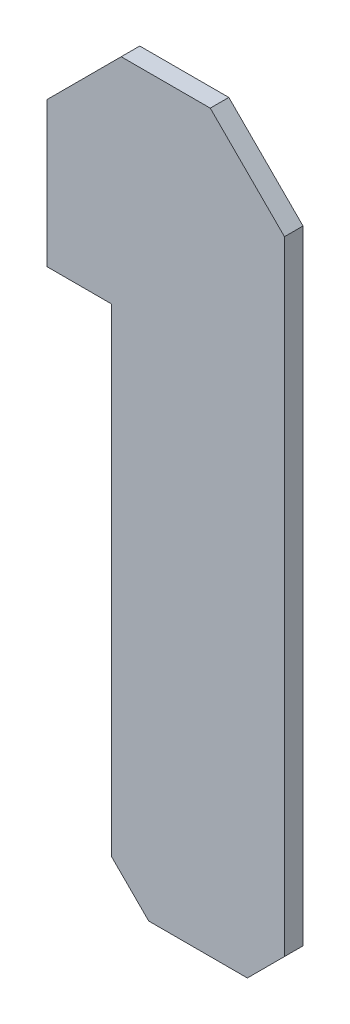
ISO-10303-21;
HEADER;
FILE_DESCRIPTION(('STEP AP214'),'2;1');
FILE_NAME('part.step','',(''),(''),'','','');
FILE_SCHEMA(('AUTOMOTIVE_DESIGN { 1 0 10303 214 1 1 1 1 }'));
ENDSEC;
DATA;
#1=APPLICATION_CONTEXT('core data for automotive mechanical design processes');
#2=APPLICATION_PROTOCOL_DEFINITION('international standard','automotive_design',2000,#1);
#3=PRODUCT_CONTEXT('',#1,'mechanical');
#4=PRODUCT('Part','Part','',(#3));
#5=PRODUCT_RELATED_PRODUCT_CATEGORY('part','',(#4));
#6=PRODUCT_DEFINITION_FORMATION('','',#4);
#7=PRODUCT_DEFINITION_CONTEXT('part definition',#1,'design');
#8=PRODUCT_DEFINITION('design','',#6,#7);
#9=PRODUCT_DEFINITION_SHAPE('','',#8);
#10=(LENGTH_UNIT() NAMED_UNIT(*) SI_UNIT(.MILLI.,.METRE.));
#11=(NAMED_UNIT(*) PLANE_ANGLE_UNIT() SI_UNIT($,.RADIAN.));
#12=(NAMED_UNIT(*) SI_UNIT($,.STERADIAN.) SOLID_ANGLE_UNIT());
#13=UNCERTAINTY_MEASURE_WITH_UNIT(LENGTH_MEASURE(1.E-05),#10,'distance_accuracy_value','');
#14=(GEOMETRIC_REPRESENTATION_CONTEXT(3) GLOBAL_UNCERTAINTY_ASSIGNED_CONTEXT((#13)) GLOBAL_UNIT_ASSIGNED_CONTEXT((#10,
#11,#12)) REPRESENTATION_CONTEXT('',''));
#15=CARTESIAN_POINT('',(0.,0.,0.));
#16=DIRECTION('',(0.,0.,1.));
#17=DIRECTION('',(1.,0.,0.));
#18=AXIS2_PLACEMENT_3D('',#15,#16,#17);
#19=CARTESIAN_POINT('',(6.4,3.15,0.5));
#20=DIRECTION('',(-0.707106781186546,-0.707106781186549,0.));
#21=DIRECTION('',(0.707106781186549,-0.707106781186546,0.));
#22=AXIS2_PLACEMENT_3D('',#19,#20,#21);
#23=PLANE('',#22);
#24=DIRECTION('',(-0.707106781186549,0.707106781186546,0.));
#25=VECTOR('',#24,1.);
#26=CARTESIAN_POINT('',(6.4,3.15,0.));
#27=LINE('',#26,#25);
#28=CARTESIAN_POINT('',(6.4,3.15,0.));
#29=VERTEX_POINT('',#28);
#30=CARTESIAN_POINT('',(4.39999999999999,5.15,0.));
#31=VERTEX_POINT('',#30);
#32=EDGE_CURVE('E143',#29,#31,#27,.T.);
#33=ORIENTED_EDGE('',*,*,#32,.T.);
#34=DIRECTION('',(0.,0.,-1.));
#35=VECTOR('',#34,1.);
#36=CARTESIAN_POINT('',(4.39999999999999,5.15,0.5));
#37=LINE('',#36,#35);
#38=CARTESIAN_POINT('',(4.39999999999999,5.15,0.5));
#39=VERTEX_POINT('',#38);
#40=EDGE_CURVE('E11',#39,#31,#37,.T.);
#41=ORIENTED_EDGE('',*,*,#40,.F.);
#42=DIRECTION('',(-0.707106781186549,0.707106781186546,0.));
#43=VECTOR('',#42,1.);
#44=CARTESIAN_POINT('',(6.4,3.15,0.5));
#45=LINE('',#44,#43);
#46=CARTESIAN_POINT('',(6.4,3.15,0.5));
#47=VERTEX_POINT('',#46);
#48=EDGE_CURVE('E163',#47,#39,#45,.T.);
#49=ORIENTED_EDGE('',*,*,#48,.F.);
#50=DIRECTION('',(0.,0.,-1.));
#51=VECTOR('',#50,1.);
#52=CARTESIAN_POINT('',(6.4,3.15,0.5));
#53=LINE('',#52,#51);
#54=EDGE_CURVE('E139',#47,#29,#53,.T.);
#55=ORIENTED_EDGE('',*,*,#54,.T.);
#56=EDGE_LOOP('',(#33,#41,#49,#55));
#57=FACE_BOUND('',#56,.T.);
#58=ADVANCED_FACE('F34',(#57),#23,.F.);
#59=CARTESIAN_POINT('',(4.39999999999999,5.15,0.5));
#60=DIRECTION('',(0.,-1.,0.));
#61=DIRECTION('',(0.,0.,-1.));
#62=AXIS2_PLACEMENT_3D('',#59,#60,#61);
#63=PLANE('',#62);
#64=DIRECTION('',(-1.,0.,0.));
#65=VECTOR('',#64,1.);
#66=CARTESIAN_POINT('',(4.39999999999999,5.15,0.));
#67=LINE('',#66,#65);
#68=CARTESIAN_POINT('',(2.,5.15,0.));
#69=VERTEX_POINT('',#68);
#70=EDGE_CURVE('E146',#31,#69,#67,.T.);
#71=ORIENTED_EDGE('',*,*,#70,.T.);
#72=DIRECTION('',(0.,0.,-1.));
#73=VECTOR('',#72,1.);
#74=CARTESIAN_POINT('',(2.,5.15,0.5));
#75=LINE('',#74,#73);
#76=CARTESIAN_POINT('',(2.,5.15,0.5));
#77=VERTEX_POINT('',#76);
#78=EDGE_CURVE('E42',#77,#69,#75,.T.);
#79=ORIENTED_EDGE('',*,*,#78,.F.);
#80=DIRECTION('',(-1.,0.,0.));
#81=VECTOR('',#80,1.);
#82=CARTESIAN_POINT('',(4.39999999999999,5.15,0.5));
#83=LINE('',#82,#81);
#84=EDGE_CURVE('E97',#39,#77,#83,.T.);
#85=ORIENTED_EDGE('',*,*,#84,.F.);
#86=ORIENTED_EDGE('',*,*,#40,.T.);
#87=EDGE_LOOP('',(#71,#79,#85,#86));
#88=FACE_BOUND('',#87,.T.);
#89=ADVANCED_FACE('F209',(#88),#63,.F.);
#90=CARTESIAN_POINT('',(2.,5.15,0.5));
#91=DIRECTION('',(0.707106781186549,-0.707106781186547,0.));
#92=DIRECTION('',(0.707106781186547,0.707106781186549,0.));
#93=AXIS2_PLACEMENT_3D('',#90,#91,#92);
#94=PLANE('',#93);
#95=DIRECTION('',(-0.707106781186547,-0.707106781186549,0.));
#96=VECTOR('',#95,1.);
#97=CARTESIAN_POINT('',(2.,5.15,0.));
#98=LINE('',#97,#96);
#99=CARTESIAN_POINT('',(0.,3.15,0.));
#100=VERTEX_POINT('',#99);
#101=EDGE_CURVE('E148',#69,#100,#98,.T.);
#102=ORIENTED_EDGE('',*,*,#101,.T.);
#103=DIRECTION('',(0.,0.,-1.));
#104=VECTOR('',#103,1.);
#105=CARTESIAN_POINT('',(0.,3.15,0.5));
#106=LINE('',#105,#104);
#107=CARTESIAN_POINT('',(0.,3.15,0.5));
#108=VERTEX_POINT('',#107);
#109=EDGE_CURVE('E176',#108,#100,#106,.T.);
#110=ORIENTED_EDGE('',*,*,#109,.F.);
#111=DIRECTION('',(-0.707106781186547,-0.707106781186549,0.));
#112=VECTOR('',#111,1.);
#113=CARTESIAN_POINT('',(2.,5.15,0.5));
#114=LINE('',#113,#112);
#115=EDGE_CURVE('E184',#77,#108,#114,.T.);
#116=ORIENTED_EDGE('',*,*,#115,.F.);
#117=ORIENTED_EDGE('',*,*,#78,.T.);
#118=EDGE_LOOP('',(#102,#110,#116,#117));
#119=FACE_BOUND('',#118,.T.);
#120=ADVANCED_FACE('F182',(#119),#94,.F.);
#121=CARTESIAN_POINT('',(0.,0.100000000000001,0.5));
#122=DIRECTION('',(1.,0.,0.));
#123=DIRECTION('',(0.,1.,0.));
#124=AXIS2_PLACEMENT_3D('',#121,#122,#123);
#125=PLANE('',#124);
#126=DIRECTION('',(0.,-1.,0.));
#127=VECTOR('',#126,1.);
#128=CARTESIAN_POINT('',(0.,0.100000000000001,0.));
#129=LINE('',#128,#127);
#130=CARTESIAN_POINT('',(0.,-0.75,0.));
#131=VERTEX_POINT('',#130);
#132=EDGE_CURVE('E151',#100,#131,#129,.T.);
#133=ORIENTED_EDGE('',*,*,#132,.T.);
#134=DIRECTION('',(0.,0.,-1.));
#135=VECTOR('',#134,1.);
#136=CARTESIAN_POINT('',(0.,-0.75,0.5));
#137=LINE('',#136,#135);
#138=CARTESIAN_POINT('',(0.,-0.75,0.5));
#139=VERTEX_POINT('',#138);
#140=EDGE_CURVE('E173',#139,#131,#137,.T.);
#141=ORIENTED_EDGE('',*,*,#140,.F.);
#142=DIRECTION('',(0.,-1.,0.));
#143=VECTOR('',#142,1.);
#144=CARTESIAN_POINT('',(0.,3.15,0.5));
#145=LINE('',#144,#143);
#146=EDGE_CURVE('E199',#108,#139,#145,.T.);
#147=ORIENTED_EDGE('',*,*,#146,.F.);
#148=ORIENTED_EDGE('',*,*,#109,.T.);
#149=EDGE_LOOP('',(#133,#141,#147,#148));
#150=FACE_BOUND('',#149,.T.);
#151=ADVANCED_FACE('F190',(#150),#125,.F.);
#152=CARTESIAN_POINT('',(0.,-0.75,0.5));
#153=DIRECTION('',(0.,1.,0.));
#154=DIRECTION('',(0.,0.,1.));
#155=AXIS2_PLACEMENT_3D('',#152,#153,#154);
#156=PLANE('',#155);
#157=DIRECTION('',(1.,0.,0.));
#158=VECTOR('',#157,1.);
#159=CARTESIAN_POINT('',(0.,-0.75,0.));
#160=LINE('',#159,#158);
#161=CARTESIAN_POINT('',(1.7422791503867,-0.75,0.));
#162=VERTEX_POINT('',#161);
#163=EDGE_CURVE('E153',#131,#162,#160,.T.);
#164=ORIENTED_EDGE('',*,*,#163,.T.);
#165=DIRECTION('',(0.,0.,-1.));
#166=VECTOR('',#165,1.);
#167=CARTESIAN_POINT('',(1.7422791503867,-0.75,0.5));
#168=LINE('',#167,#166);
#169=CARTESIAN_POINT('',(1.7422791503867,-0.75,0.5));
#170=VERTEX_POINT('',#169);
#171=EDGE_CURVE('E170',#170,#162,#168,.T.);
#172=ORIENTED_EDGE('',*,*,#171,.F.);
#173=DIRECTION('',(1.,0.,0.));
#174=VECTOR('',#173,1.);
#175=CARTESIAN_POINT('',(0.,-0.75,0.5));
#176=LINE('',#175,#174);
#177=EDGE_CURVE('E196',#139,#170,#176,.T.);
#178=ORIENTED_EDGE('',*,*,#177,.F.);
#179=ORIENTED_EDGE('',*,*,#140,.T.);
#180=EDGE_LOOP('',(#164,#172,#178,#179));
#181=FACE_BOUND('',#180,.T.);
#182=ADVANCED_FACE('F194',(#181),#156,.F.);
#183=CARTESIAN_POINT('',(1.7422791503867,-0.75,0.5));
#184=DIRECTION('',(1.,0.,0.));
#185=DIRECTION('',(0.,1.,0.));
#186=AXIS2_PLACEMENT_3D('',#183,#184,#185);
#187=PLANE('',#186);
#188=DIRECTION('',(0.,-1.,0.));
#189=VECTOR('',#188,1.);
#190=CARTESIAN_POINT('',(1.7422791503867,-0.75,0.));
#191=LINE('',#190,#189);
#192=CARTESIAN_POINT('',(1.7422791503867,-13.65,0.));
#193=VERTEX_POINT('',#192);
#194=EDGE_CURVE('E155',#162,#193,#191,.T.);
#195=ORIENTED_EDGE('',*,*,#194,.T.);
#196=DIRECTION('',(0.,0.,-1.));
#197=VECTOR('',#196,1.);
#198=CARTESIAN_POINT('',(1.7422791503867,-13.65,0.5));
#199=LINE('',#198,#197);
#200=CARTESIAN_POINT('',(1.7422791503867,-13.65,0.5));
#201=VERTEX_POINT('',#200);
#202=EDGE_CURVE('E167',#201,#193,#199,.T.);
#203=ORIENTED_EDGE('',*,*,#202,.F.);
#204=DIRECTION('',(0.,-1.,0.));
#205=VECTOR('',#204,1.);
#206=CARTESIAN_POINT('',(1.7422791503867,-0.75,0.5));
#207=LINE('',#206,#205);
#208=EDGE_CURVE('E198',#170,#201,#207,.T.);
#209=ORIENTED_EDGE('',*,*,#208,.F.);
#210=ORIENTED_EDGE('',*,*,#171,.T.);
#211=EDGE_LOOP('',(#195,#203,#209,#210));
#212=FACE_BOUND('',#211,.T.);
#213=ADVANCED_FACE('F221',(#212),#187,.F.);
#214=CARTESIAN_POINT('',(1.7422791503867,-13.65,0.5));
#215=DIRECTION('',(0.707106781186548,0.707106781186547,0.));
#216=DIRECTION('',(-0.707106781186547,0.707106781186548,0.));
#217=AXIS2_PLACEMENT_3D('',#214,#215,#216);
#218=PLANE('',#217);
#219=DIRECTION('',(0.707106781186547,-0.707106781186548,0.));
#220=VECTOR('',#219,1.);
#221=CARTESIAN_POINT('',(1.7422791503867,-13.65,0.));
#222=LINE('',#221,#220);
#223=CARTESIAN_POINT('',(2.7422791503867,-14.65,0.));
#224=VERTEX_POINT('',#223);
#225=EDGE_CURVE('E157',#193,#224,#222,.T.);
#226=ORIENTED_EDGE('',*,*,#225,.T.);
#227=DIRECTION('',(0.,0.,-1.));
#228=VECTOR('',#227,1.);
#229=CARTESIAN_POINT('',(2.7422791503867,-14.65,0.5));
#230=LINE('',#229,#228);
#231=CARTESIAN_POINT('',(2.7422791503867,-14.65,0.5));
#232=VERTEX_POINT('',#231);
#233=EDGE_CURVE('E134',#232,#224,#230,.T.);
#234=ORIENTED_EDGE('',*,*,#233,.F.);
#235=DIRECTION('',(0.707106781186547,-0.707106781186548,0.));
#236=VECTOR('',#235,1.);
#237=CARTESIAN_POINT('',(1.7422791503867,-13.65,0.5));
#238=LINE('',#237,#236);
#239=EDGE_CURVE('E123',#201,#232,#238,.T.);
#240=ORIENTED_EDGE('',*,*,#239,.F.);
#241=ORIENTED_EDGE('',*,*,#202,.T.);
#242=EDGE_LOOP('',(#226,#234,#240,#241));
#243=FACE_BOUND('',#242,.T.);
#244=ADVANCED_FACE('F224',(#243),#218,.F.);
#245=CARTESIAN_POINT('',(2.7422791503867,-14.65,0.5));
#246=DIRECTION('',(0.,1.,0.));
#247=DIRECTION('',(0.,0.,1.));
#248=AXIS2_PLACEMENT_3D('',#245,#246,#247);
#249=PLANE('',#248);
#250=DIRECTION('',(1.,0.,0.));
#251=VECTOR('',#250,1.);
#252=CARTESIAN_POINT('',(2.7422791503867,-14.65,0.));
#253=LINE('',#252,#251);
#254=CARTESIAN_POINT('',(5.4,-14.65,0.));
#255=VERTEX_POINT('',#254);
#256=EDGE_CURVE('E132',#224,#255,#253,.T.);
#257=ORIENTED_EDGE('',*,*,#256,.T.);
#258=DIRECTION('',(0.,0.,-1.));
#259=VECTOR('',#258,1.);
#260=CARTESIAN_POINT('',(5.4,-14.65,0.5));
#261=LINE('',#260,#259);
#262=CARTESIAN_POINT('',(5.4,-14.65,0.5));
#263=VERTEX_POINT('',#262);
#264=EDGE_CURVE('E129',#263,#255,#261,.T.);
#265=ORIENTED_EDGE('',*,*,#264,.F.);
#266=DIRECTION('',(1.,0.,0.));
#267=VECTOR('',#266,1.);
#268=CARTESIAN_POINT('',(2.7422791503867,-14.65,0.5));
#269=LINE('',#268,#267);
#270=EDGE_CURVE('E116',#232,#263,#269,.T.);
#271=ORIENTED_EDGE('',*,*,#270,.F.);
#272=ORIENTED_EDGE('',*,*,#233,.T.);
#273=EDGE_LOOP('',(#257,#265,#271,#272));
#274=FACE_BOUND('',#273,.T.);
#275=ADVANCED_FACE('F130',(#274),#249,.F.);
#276=CARTESIAN_POINT('',(5.4,-14.65,0.5));
#277=DIRECTION('',(-0.707106781186547,0.707106781186547,0.));
#278=DIRECTION('',(-0.707106781186548,-0.707106781186548,0.));
#279=AXIS2_PLACEMENT_3D('',#276,#277,#278);
#280=PLANE('',#279);
#281=DIRECTION('',(0.707106781186547,0.707106781186547,0.));
#282=VECTOR('',#281,1.);
#283=CARTESIAN_POINT('',(5.4,-14.65,0.));
#284=LINE('',#283,#282);
#285=CARTESIAN_POINT('',(6.4,-13.65,0.));
#286=VERTEX_POINT('',#285);
#287=EDGE_CURVE('E160',#255,#286,#284,.T.);
#288=ORIENTED_EDGE('',*,*,#287,.T.);
#289=DIRECTION('',(0.,0.,-1.));
#290=VECTOR('',#289,1.);
#291=CARTESIAN_POINT('',(6.4,-13.65,0.5));
#292=LINE('',#291,#290);
#293=CARTESIAN_POINT('',(6.4,-13.65,0.5));
#294=VERTEX_POINT('',#293);
#295=EDGE_CURVE('E135',#294,#286,#292,.T.);
#296=ORIENTED_EDGE('',*,*,#295,.F.);
#297=DIRECTION('',(0.707106781186547,0.707106781186547,0.));
#298=VECTOR('',#297,1.);
#299=CARTESIAN_POINT('',(5.4,-14.65,0.5));
#300=LINE('',#299,#298);
#301=EDGE_CURVE('E120',#263,#294,#300,.T.);
#302=ORIENTED_EDGE('',*,*,#301,.F.);
#303=ORIENTED_EDGE('',*,*,#264,.T.);
#304=EDGE_LOOP('',(#288,#296,#302,#303));
#305=FACE_BOUND('',#304,.T.);
#306=ADVANCED_FACE('F137',(#305),#280,.F.);
#307=CARTESIAN_POINT('',(6.4,3.15,0.5));
#308=DIRECTION('',(-1.,0.,0.));
#309=DIRECTION('',(0.,0.,1.));
#310=AXIS2_PLACEMENT_3D('',#307,#308,#309);
#311=PLANE('',#310);
#312=DIRECTION('',(0.,1.,0.));
#313=VECTOR('',#312,1.);
#314=CARTESIAN_POINT('',(6.4,3.15,0.));
#315=LINE('',#314,#313);
#316=EDGE_CURVE('E85',#286,#29,#315,.T.);
#317=ORIENTED_EDGE('',*,*,#316,.T.);
#318=ORIENTED_EDGE('',*,*,#54,.F.);
#319=DIRECTION('',(0.,1.,0.));
#320=VECTOR('',#319,1.);
#321=CARTESIAN_POINT('',(6.4,-13.65,0.5));
#322=LINE('',#321,#320);
#323=EDGE_CURVE('E50',#294,#47,#322,.T.);
#324=ORIENTED_EDGE('',*,*,#323,.F.);
#325=ORIENTED_EDGE('',*,*,#295,.T.);
#326=EDGE_LOOP('',(#317,#318,#324,#325));
#327=FACE_BOUND('',#326,.T.);
#328=ADVANCED_FACE('F233',(#327),#311,.F.);
#329=CARTESIAN_POINT('',(0.,0.,0.5));
#330=DIRECTION('',(0.,0.,1.));
#331=DIRECTION('',(1.,0.,0.));
#332=AXIS2_PLACEMENT_3D('',#329,#330,#331);
#333=PLANE('',#332);
#334=ORIENTED_EDGE('',*,*,#48,.T.);
#335=ORIENTED_EDGE('',*,*,#84,.T.);
#336=ORIENTED_EDGE('',*,*,#115,.T.);
#337=ORIENTED_EDGE('',*,*,#146,.T.);
#338=ORIENTED_EDGE('',*,*,#177,.T.);
#339=ORIENTED_EDGE('',*,*,#208,.T.);
#340=ORIENTED_EDGE('',*,*,#239,.T.);
#341=ORIENTED_EDGE('',*,*,#270,.T.);
#342=ORIENTED_EDGE('',*,*,#301,.T.);
#343=ORIENTED_EDGE('',*,*,#323,.T.);
#344=EDGE_LOOP('',(#334,#335,#336,#337,#338,#339,#340,#341,#342,#343));
#345=FACE_BOUND('',#344,.T.);
#346=ADVANCED_FACE('F118',(#345),#333,.T.);
#347=CARTESIAN_POINT('',(0.,0.,0.));
#348=DIRECTION('',(0.,0.,1.));
#349=DIRECTION('',(1.,0.,0.));
#350=AXIS2_PLACEMENT_3D('',#347,#348,#349);
#351=PLANE('',#350);
#352=ORIENTED_EDGE('',*,*,#32,.F.);
#353=ORIENTED_EDGE('',*,*,#316,.F.);
#354=ORIENTED_EDGE('',*,*,#287,.F.);
#355=ORIENTED_EDGE('',*,*,#256,.F.);
#356=ORIENTED_EDGE('',*,*,#225,.F.);
#357=ORIENTED_EDGE('',*,*,#194,.F.);
#358=ORIENTED_EDGE('',*,*,#163,.F.);
#359=ORIENTED_EDGE('',*,*,#132,.F.);
#360=ORIENTED_EDGE('',*,*,#101,.F.);
#361=ORIENTED_EDGE('',*,*,#70,.F.);
#362=EDGE_LOOP('',(#352,#353,#354,#355,#356,#357,#358,#359,#360,#361));
#363=FACE_BOUND('',#362,.T.);
#364=ADVANCED_FACE('F185',(#363),#351,.F.);
#365=CLOSED_SHELL('',(#58,#89,#120,#151,#182,#213,#244,#275,#306,#328,#346,#364));
#366=MANIFOLD_SOLID_BREP('B2',#365);
#367=ADVANCED_BREP_SHAPE_REPRESENTATION('',(#18,#366),#14);
#368=SHAPE_DEFINITION_REPRESENTATION(#9,#367);
ENDSEC;
END-ISO-10303-21;
